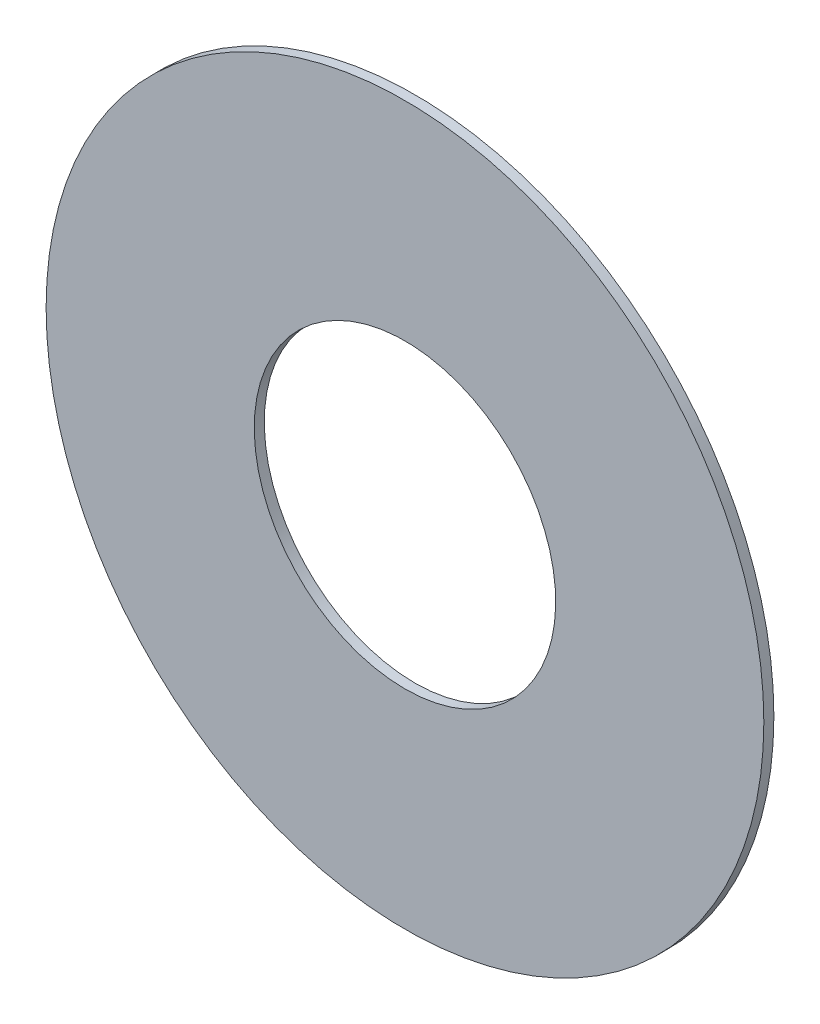
ISO-10303-21;
HEADER;
FILE_DESCRIPTION(('STEP AP214'),'2;1');
FILE_NAME('part.step','',(''),(''),'','','');
FILE_SCHEMA(('AUTOMOTIVE_DESIGN { 1 0 10303 214 1 1 1 1 }'));
ENDSEC;
DATA;
#1=APPLICATION_CONTEXT('core data for automotive mechanical design processes');
#2=APPLICATION_PROTOCOL_DEFINITION('international standard','automotive_design',2000,#1);
#3=PRODUCT_CONTEXT('',#1,'mechanical');
#4=PRODUCT('Part','Part','',(#3));
#5=PRODUCT_RELATED_PRODUCT_CATEGORY('part','',(#4));
#6=PRODUCT_DEFINITION_FORMATION('','',#4);
#7=PRODUCT_DEFINITION_CONTEXT('part definition',#1,'design');
#8=PRODUCT_DEFINITION('design','',#6,#7);
#9=PRODUCT_DEFINITION_SHAPE('','',#8);
#10=(LENGTH_UNIT() NAMED_UNIT(*) SI_UNIT(.MILLI.,.METRE.));
#11=(NAMED_UNIT(*) PLANE_ANGLE_UNIT() SI_UNIT($,.RADIAN.));
#12=(NAMED_UNIT(*) SI_UNIT($,.STERADIAN.) SOLID_ANGLE_UNIT());
#13=UNCERTAINTY_MEASURE_WITH_UNIT(LENGTH_MEASURE(1.E-05),#10,'distance_accuracy_value','');
#14=(GEOMETRIC_REPRESENTATION_CONTEXT(3) GLOBAL_UNCERTAINTY_ASSIGNED_CONTEXT((#13)) GLOBAL_UNIT_ASSIGNED_CONTEXT((#10,
#11,#12)) REPRESENTATION_CONTEXT('',''));
#15=CARTESIAN_POINT('',(0.,0.,0.));
#16=DIRECTION('',(0.,0.,1.));
#17=DIRECTION('',(1.,0.,0.));
#18=AXIS2_PLACEMENT_3D('',#15,#16,#17);
#19=CARTESIAN_POINT('',(144.202,-113.984,-0.045));
#20=DIRECTION('',(0.,0.,-1.));
#21=DIRECTION('',(0.,-1.,0.));
#22=AXIS2_PLACEMENT_3D('',#19,#20,#21);
#23=CYLINDRICAL_SURFACE('',#22,0.525);
#24=CARTESIAN_POINT('',(144.202,-113.984,1.67));
#25=DIRECTION('',(0.,0.,-1.));
#26=DIRECTION('',(0.,-1.,0.));
#27=AXIS2_PLACEMENT_3D('',#24,#25,#26);
#28=CIRCLE('',#27,0.525);
#29=CARTESIAN_POINT('',(144.202,-114.509,1.67));
#30=VERTEX_POINT('',#29);
#31=EDGE_CURVE('E25',#30,#30,#28,.T.);
#32=ORIENTED_EDGE('',*,*,#31,.T.);
#33=DIRECTION('',(0.,0.,1.));
#34=VECTOR('',#33,1.);
#35=CARTESIAN_POINT('',(144.202,-114.509,-0.045));
#36=LINE('',#35,#34);
#37=CARTESIAN_POINT('',(144.202,-114.509,1.705));
#38=VERTEX_POINT('',#37);
#39=EDGE_CURVE('E11',#30,#38,#36,.T.);
#40=ORIENTED_EDGE('',*,*,#39,.T.);
#41=CARTESIAN_POINT('',(144.202,-113.984,1.705));
#42=DIRECTION('',(0.,0.,-1.));
#43=DIRECTION('',(0.,-1.,0.));
#44=AXIS2_PLACEMENT_3D('',#41,#42,#43);
#45=CIRCLE('',#44,0.525);
#46=EDGE_CURVE('E69',#38,#38,#45,.T.);
#47=ORIENTED_EDGE('',*,*,#46,.F.);
#48=ORIENTED_EDGE('',*,*,#39,.F.);
#49=EDGE_LOOP('',(#32,#40,#47,#48));
#50=FACE_BOUND('',#49,.T.);
#51=ADVANCED_FACE('F17',(#50),#23,.F.);
#52=CARTESIAN_POINT('',(144.202,-113.984,1.67));
#53=DIRECTION('',(0.,0.,1.));
#54=DIRECTION('',(1.,0.,0.));
#55=AXIS2_PLACEMENT_3D('',#52,#53,#54);
#56=PLANE('',#55);
#57=ORIENTED_EDGE('',*,*,#31,.F.);
#58=EDGE_LOOP('',(#57));
#59=FACE_BOUND('',#58,.T.);
#60=CARTESIAN_POINT('',(144.202,-113.984,1.67));
#61=DIRECTION('',(0.,0.,1.));
#62=DIRECTION('',(1.,0.,0.));
#63=AXIS2_PLACEMENT_3D('',#60,#61,#62);
#64=CIRCLE('',#63,1.25);
#65=CARTESIAN_POINT('',(145.452,-113.984,1.67));
#66=VERTEX_POINT('',#65);
#67=EDGE_CURVE('E56',#66,#66,#64,.T.);
#68=ORIENTED_EDGE('',*,*,#67,.F.);
#69=EDGE_LOOP('',(#68));
#70=FACE_BOUND('',#69,.T.);
#71=ADVANCED_FACE('F76',(#59,#70),#56,.F.);
#72=CARTESIAN_POINT('',(144.202,-113.984,1.705));
#73=DIRECTION('',(0.,0.,1.));
#74=DIRECTION('',(1.,0.,0.));
#75=AXIS2_PLACEMENT_3D('',#72,#73,#74);
#76=PLANE('',#75);
#77=ORIENTED_EDGE('',*,*,#46,.T.);
#78=EDGE_LOOP('',(#77));
#79=FACE_BOUND('',#78,.T.);
#80=CARTESIAN_POINT('',(144.202,-113.984,1.705));
#81=DIRECTION('',(0.,0.,1.));
#82=DIRECTION('',(1.,0.,0.));
#83=AXIS2_PLACEMENT_3D('',#80,#81,#82);
#84=CIRCLE('',#83,1.25);
#85=CARTESIAN_POINT('',(145.452,-113.984,1.705));
#86=VERTEX_POINT('',#85);
#87=EDGE_CURVE('E54',#86,#86,#84,.T.);
#88=ORIENTED_EDGE('',*,*,#87,.T.);
#89=EDGE_LOOP('',(#88));
#90=FACE_BOUND('',#89,.T.);
#91=ADVANCED_FACE('F60',(#79,#90),#76,.T.);
#92=CARTESIAN_POINT('',(144.202,-113.984,1.67));
#93=DIRECTION('',(0.,0.,1.));
#94=DIRECTION('',(1.,0.,0.));
#95=AXIS2_PLACEMENT_3D('',#92,#93,#94);
#96=CYLINDRICAL_SURFACE('',#95,1.25);
#97=ORIENTED_EDGE('',*,*,#87,.F.);
#98=DIRECTION('',(0.,0.,1.));
#99=VECTOR('',#98,1.);
#100=CARTESIAN_POINT('',(145.452,-113.984,1.67));
#101=LINE('',#100,#99);
#102=EDGE_CURVE('E51',#66,#86,#101,.T.);
#103=ORIENTED_EDGE('',*,*,#102,.F.);
#104=ORIENTED_EDGE('',*,*,#67,.T.);
#105=ORIENTED_EDGE('',*,*,#102,.T.);
#106=EDGE_LOOP('',(#97,#103,#104,#105));
#107=FACE_BOUND('',#106,.T.);
#108=ADVANCED_FACE('F53',(#107),#96,.T.);
#109=CLOSED_SHELL('',(#51,#71,#91,#108));
#110=MANIFOLD_SOLID_BREP('B1',#109);
#111=ADVANCED_BREP_SHAPE_REPRESENTATION('',(#18,#110),#14);
#112=SHAPE_DEFINITION_REPRESENTATION(#9,#111);
ENDSEC;
END-ISO-10303-21;
